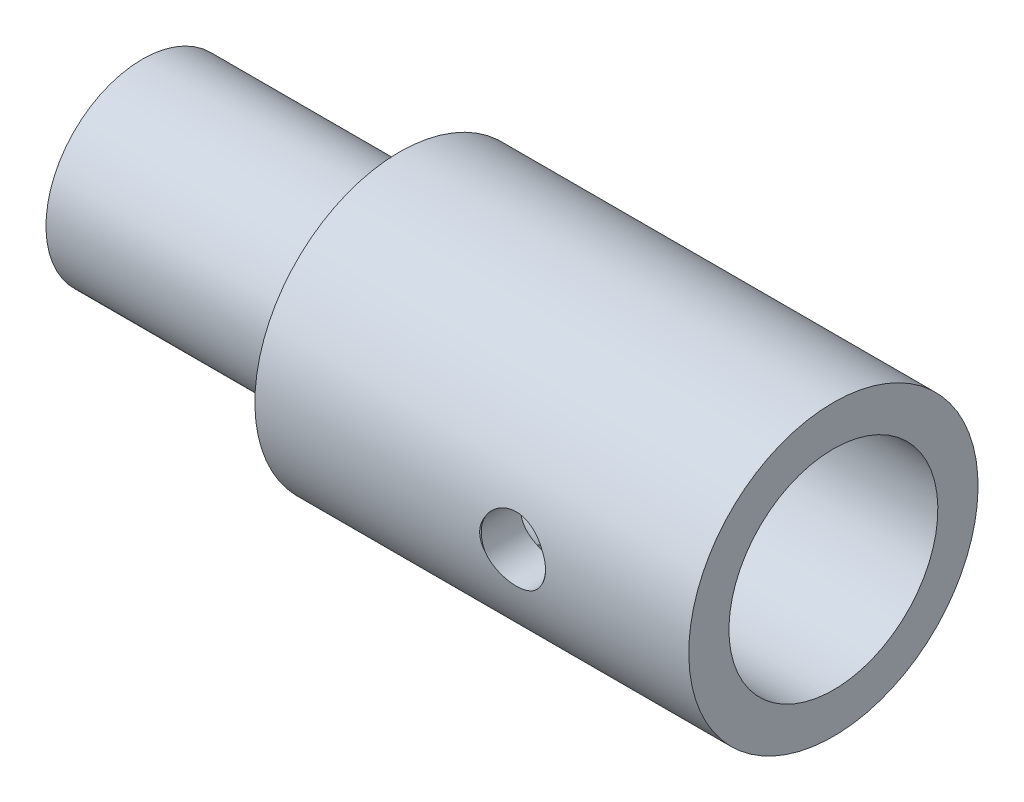
ISO-10303-21;
HEADER;
FILE_DESCRIPTION(('STEP AP214'),'2;1');
FILE_NAME('part.step','',(''),(''),'','','');
FILE_SCHEMA(('AUTOMOTIVE_DESIGN { 1 0 10303 214 1 1 1 1 }'));
ENDSEC;
DATA;
#1=APPLICATION_CONTEXT('core data for automotive mechanical design processes');
#2=APPLICATION_PROTOCOL_DEFINITION('international standard','automotive_design',2000,#1);
#3=PRODUCT_CONTEXT('',#1,'mechanical');
#4=PRODUCT('Part','Part','',(#3));
#5=PRODUCT_RELATED_PRODUCT_CATEGORY('part','',(#4));
#6=PRODUCT_DEFINITION_FORMATION('','',#4);
#7=PRODUCT_DEFINITION_CONTEXT('part definition',#1,'design');
#8=PRODUCT_DEFINITION('design','',#6,#7);
#9=PRODUCT_DEFINITION_SHAPE('','',#8);
#10=(LENGTH_UNIT() NAMED_UNIT(*) SI_UNIT(.MILLI.,.METRE.));
#11=(NAMED_UNIT(*) PLANE_ANGLE_UNIT() SI_UNIT($,.RADIAN.));
#12=(NAMED_UNIT(*) SI_UNIT($,.STERADIAN.) SOLID_ANGLE_UNIT());
#13=UNCERTAINTY_MEASURE_WITH_UNIT(LENGTH_MEASURE(1.E-05),#10,'distance_accuracy_value','');
#14=(GEOMETRIC_REPRESENTATION_CONTEXT(3) GLOBAL_UNCERTAINTY_ASSIGNED_CONTEXT((#13)) GLOBAL_UNIT_ASSIGNED_CONTEXT((#10,
#11,#12)) REPRESENTATION_CONTEXT('',''));
#15=CARTESIAN_POINT('',(0.,0.,0.));
#16=DIRECTION('',(0.,0.,1.));
#17=DIRECTION('',(1.,0.,0.));
#18=AXIS2_PLACEMENT_3D('',#15,#16,#17);
#19=CARTESIAN_POINT('',(5.50148488713848E-12,-1.97187415547967,0.));
#20=DIRECTION('',(1.,0.,0.));
#21=DIRECTION('',(0.,1.,0.));
#22=AXIS2_PLACEMENT_3D('',#19,#20,#21);
#23=CYLINDRICAL_SURFACE('',#22,4.5);
#24=CARTESIAN_POINT('',(4.06816565897068,-2.97786365577194,-4.38611275793289));
#25=CARTESIAN_POINT('',(4.12358684281742,-2.97786178204329,-4.38611388022008));
#26=CARTESIAN_POINT('',(4.17903036526716,-2.97324217517765,-4.38718060281187));
#27=CARTESIAN_POINT('',(4.28833907198498,-2.95490686869423,-4.3913246091951));
#28=CARTESIAN_POINT('',(4.34220311067269,-2.94118472957492,-4.39440331632338));
#29=CARTESIAN_POINT('',(4.44675587011614,-2.90509875425354,-4.40220739017265));
#30=CARTESIAN_POINT('',(4.49744806597373,-2.88274457510956,-4.40693091618149));
#31=CARTESIAN_POINT('',(4.5943631624964,-2.83005637971181,-4.41749273320052));
#32=CARTESIAN_POINT('',(4.64058612484138,-2.79972247360778,-4.42333100882273));
#33=CARTESIAN_POINT('',(4.72805694465566,-2.73137150551466,-4.4355816738797));
#34=CARTESIAN_POINT('',(4.76921554003076,-2.69324154702862,-4.44200162318491));
#35=CARTESIAN_POINT('',(4.84460703518999,-2.61062370478768,-4.45463155503406));
#36=CARTESIAN_POINT('',(4.87883938579245,-2.56613531735005,-4.46084152089593));
#37=CARTESIAN_POINT('',(4.9397610346684,-2.47146302093907,-4.47243852091702));
#38=CARTESIAN_POINT('',(4.96636428369726,-2.42122245170821,-4.47781587473164));
#39=CARTESIAN_POINT('',(5.01071555983091,-2.31684403991639,-4.48706330066551));
#40=CARTESIAN_POINT('',(5.02846461320618,-2.26270664986017,-4.49093354745883));
#41=CARTESIAN_POINT('',(5.05432237544011,-2.15299925218796,-4.49668331515777));
#42=CARTESIAN_POINT('',(5.06258221357088,-2.09746652512711,-4.49859399063802));
#43=CARTESIAN_POINT('',(5.06969979440689,-1.98577249915794,-4.50032496339697));
#44=CARTESIAN_POINT('',(5.06855864593759,-1.92961127515974,-4.50014550720102));
#45=CARTESIAN_POINT('',(5.05701879772266,-1.8192970324395,-4.49774525964353));
#46=CARTESIAN_POINT('',(5.04678301942513,-1.7651260671216,-4.49556037099857));
#47=CARTESIAN_POINT('',(5.0176043251931,-1.65928808602436,-4.48944335927617));
#48=CARTESIAN_POINT('',(4.99866100734405,-1.60762118594706,-4.48551115554806));
#49=CARTESIAN_POINT('',(4.95246217192021,-1.5078085246682,-4.47629047558497));
#50=CARTESIAN_POINT('',(4.92514530069846,-1.45969211986332,-4.47099203593512));
#51=CARTESIAN_POINT('',(4.86302061199618,-1.36866595602941,-4.45962410322717));
#52=CARTESIAN_POINT('',(4.8282117434357,-1.3257569288849,-4.45355450202897));
#53=CARTESIAN_POINT('',(4.7512055620442,-1.2453947072631,-4.44116186417056));
#54=CARTESIAN_POINT('',(4.70886567098526,-1.20807842128984,-4.43483618409231));
#55=CARTESIAN_POINT('',(4.61846428516214,-1.14105047855525,-4.42277009160468));
#56=CARTESIAN_POINT('',(4.57040262508354,-1.11133904159283,-4.41702969611435));
#57=CARTESIAN_POINT('',(4.46969571479634,-1.06030125801364,-4.40678088796344));
#58=CARTESIAN_POINT('',(4.41703654756835,-1.03900153035072,-4.40227639985761));
#59=CARTESIAN_POINT('',(4.30876257332954,-1.0055976940685,-4.39506596897663));
#60=CARTESIAN_POINT('',(4.25314825354202,-0.993492074596205,-4.39235973070713));
#61=CARTESIAN_POINT('',(4.14179566544082,-0.979034396203422,-4.38911420354963));
#62=CARTESIAN_POINT('',(4.08608459345075,-0.976482597592141,-4.38853054587544));
#63=CARTESIAN_POINT('',(3.9750331974894,-0.980663650115781,-4.38947675954616));
#64=CARTESIAN_POINT('',(3.91969284744146,-0.987395841173553,-4.39100648063315));
#65=CARTESIAN_POINT('',(3.81165389022239,-1.0097800855435,-4.39596433032525));
#66=CARTESIAN_POINT('',(3.75893117132254,-1.02532147177501,-4.39936889109465));
#67=CARTESIAN_POINT('',(3.65683734340634,-1.06476242955664,-4.4076696724518));
#68=CARTESIAN_POINT('',(3.60746656422095,-1.08866282221392,-4.41256603957395));
#69=CARTESIAN_POINT('',(3.51261585808247,-1.14458049664969,-4.42339303553741));
#70=CARTESIAN_POINT('',(3.46721000147815,-1.17672042314935,-4.4293388269128));
#71=CARTESIAN_POINT('',(3.38236148026634,-1.24804421453478,-4.44155112847036));
#72=CARTESIAN_POINT('',(3.34291958245639,-1.28722898377405,-4.44781767975484));
#73=CARTESIAN_POINT('',(3.27033998721639,-1.37243458019633,-4.46010726941679));
#74=CARTESIAN_POINT('',(3.23733864103595,-1.4185727395202,-4.46612327448254));
#75=CARTESIAN_POINT('',(3.17955359185368,-1.51585244292499,-4.47710135779606));
#76=CARTESIAN_POINT('',(3.15476949865396,-1.5669937492811,-4.48206348608336));
#77=CARTESIAN_POINT('',(3.11431060165398,-1.67250379584717,-4.49034037317875));
#78=CARTESIAN_POINT('',(3.0985770610236,-1.72684914268447,-4.49366573355759));
#79=CARTESIAN_POINT('',(3.07648307896242,-1.83749326969315,-4.49833355276864));
#80=CARTESIAN_POINT('',(3.07012122861376,-1.89379175493145,-4.49967630966085));
#81=CARTESIAN_POINT('',(3.06701626778621,-2.00545095950041,-4.50021372662241));
#82=CARTESIAN_POINT('',(3.07006984364107,-2.06080590366832,-4.49945382739966));
#83=CARTESIAN_POINT('',(3.08525313424904,-2.17018990459246,-4.49596105327091));
#84=CARTESIAN_POINT('',(3.09738267551814,-2.22421898667171,-4.49322821607698));
#85=CARTESIAN_POINT('',(3.1302748375681,-2.32925470319202,-4.48609441855509));
#86=CARTESIAN_POINT('',(3.15100777092128,-2.38027104867429,-4.48169919912522));
#87=CARTESIAN_POINT('',(3.20048956074017,-2.47812581487664,-4.47170339578977));
#88=CARTESIAN_POINT('',(3.22923922205992,-2.52496381548064,-4.46610269087016));
#89=CARTESIAN_POINT('',(3.29459679770311,-2.61412168091815,-4.45416467449891));
#90=CARTESIAN_POINT('',(3.33134717681878,-2.65633548036275,-4.44781511651287));
#91=CARTESIAN_POINT('',(3.41137672719349,-2.73406625709728,-4.43515701366091));
#92=CARTESIAN_POINT('',(3.45465747685313,-2.76958161068036,-4.42884847909599));
#93=CARTESIAN_POINT('',(3.54724290887576,-2.83338479118774,-4.41688470759027));
#94=CARTESIAN_POINT('',(3.59662296738546,-2.86156528376162,-4.41123977134785));
#95=CARTESIAN_POINT('',(3.69953410670133,-2.90918455284614,-4.40136855073445));
#96=CARTESIAN_POINT('',(3.75306168103588,-2.92863062123867,-4.39714108374806));
#97=CARTESIAN_POINT('',(3.85021889599066,-2.95481753246029,-4.39135014366362));
#98=CARTESIAN_POINT('',(3.89332737260432,-2.96344303980899,-4.38939927902104));
#99=CARTESIAN_POINT('',(3.98034113726387,-2.97496669518073,-4.38678017477402));
#100=CARTESIAN_POINT('',(4.02424638381067,-2.97786514063383,-4.38611186856106));
#101=CARTESIAN_POINT('',(4.06816565897068,-2.97786365577194,-4.38611275793289));
#102=B_SPLINE_CURVE_WITH_KNOTS('',3,(#24,#25,#26,#27,#28,#29,#30,#31,#32,#33,#34,#35,#36,#37,
#38,#39,#40,#41,#42,#43,#44,#45,#46,#47,#48,#49,#50,#51,#52,#53,#54,#55,#56,#57,#58,#59,#60,#61,
#62,#63,#64,#65,#66,#67,#68,#69,#70,#71,#72,#73,#74,#75,#76,#77,#78,#79,#80,#81,#82,#83,#84,#85,
#86,#87,#88,#89,#90,#91,#92,#93,#94,#95,#96,#97,#98,#99,#100,#101),.UNSPECIFIED.,.T.,.F.,(4,2,2,
2,2,2,2,2,2,2,2,2,2,2,2,2,2,2,2,2,2,2,2,2,2,2,2,2,2,2,2,2,2,2,2,2,2,2,4),(0.,0.166102558494591,
0.332322750192434,0.498357520008391,0.664389998050726,0.8330229695677,1.00166930675099,
1.17214906318353,1.34260905508582,1.51031485736443,1.67800087939989,1.84274220917405,
2.00749114368963,2.17347729000196,2.33948673831992,2.50906023645939,2.67863863513816,
2.84874944722111,3.01883229921633,3.18533874755265,3.35183335815117,3.51628128972295,
3.68074537959258,3.84781614360498,4.01490836999235,4.18522523018715,4.35553400169375,
4.52472464724765,4.6938898544815,4.85942793779578,5.02496285698629,5.18993125886615,
5.35491622901635,5.52312234724342,5.69136918646787,5.86195485764064,6.03239785047426,
6.16403493145228,6.29566517579134),.UNSPECIFIED.);
#103=CARTESIAN_POINT('',(4.06816565897068,-2.97786365577194,-4.38611275793289));
#104=VERTEX_POINT('',#103);
#105=EDGE_CURVE('E44',#104,#104,#102,.T.);
#106=ORIENTED_EDGE('',*,*,#105,.T.);
#107=EDGE_LOOP('',(#106));
#108=FACE_BOUND('',#107,.T.);
#109=CARTESIAN_POINT('',(-3.95031497845633,-1.97187415547967,0.));
#110=DIRECTION('',(1.,0.,0.));
#111=DIRECTION('',(0.,1.,0.));
#112=AXIS2_PLACEMENT_3D('',#109,#110,#111);
#113=CIRCLE('',#112,4.5);
#114=CARTESIAN_POINT('',(-3.95031497845633,2.52812584452033,0.));
#115=VERTEX_POINT('',#114);
#116=EDGE_CURVE('E158',#115,#115,#113,.T.);
#117=ORIENTED_EDGE('',*,*,#116,.T.);
#118=EDGE_LOOP('',(#117));
#119=FACE_BOUND('',#118,.T.);
#120=CARTESIAN_POINT('',(9.54968502154367,-1.97187415547967,0.));
#121=DIRECTION('',(1.,0.,0.));
#122=DIRECTION('',(0.,1.,0.));
#123=AXIS2_PLACEMENT_3D('',#120,#121,#122);
#124=CIRCLE('',#123,4.5);
#125=CARTESIAN_POINT('',(9.54968502154367,2.52812584452033,0.));
#126=VERTEX_POINT('',#125);
#127=EDGE_CURVE('E156',#126,#126,#124,.T.);
#128=ORIENTED_EDGE('',*,*,#127,.F.);
#129=EDGE_LOOP('',(#128));
#130=FACE_BOUND('',#129,.T.);
#131=CARTESIAN_POINT('',(4.92676675885765,-1.46000971657263,4.47079353092741));
#132=CARTESIAN_POINT('',(4.95559432001063,-1.49993080876618,4.47538312217792));
#133=CARTESIAN_POINT('',(4.98120629274377,-1.54227817298513,4.47967206091811));
#134=CARTESIAN_POINT('',(5.02515853043864,-1.63078110885479,4.4872693477127));
#135=CARTESIAN_POINT('',(5.04348260506502,-1.67694488725059,4.49057550842199));
#136=CARTESIAN_POINT('',(5.0720216654432,-1.77231242101153,4.49582972378611));
#137=CARTESIAN_POINT('',(5.08215585816204,-1.82154142454459,4.497764224718));
#138=CARTESIAN_POINT('',(5.09345686207469,-1.92097127359426,4.49998573066868));
#139=CARTESIAN_POINT('',(5.09464031352716,-1.97117014169085,4.50027579260054));
#140=CARTESIAN_POINT('',(5.08825001195601,-2.06749512284068,4.49922429353996));
#141=CARTESIAN_POINT('',(5.0812738326517,-2.11366360356539,4.49799374112407));
#142=CARTESIAN_POINT('',(5.0598557227474,-2.20423276144231,4.49422585348629));
#143=CARTESIAN_POINT('',(5.04540561484072,-2.24863144481492,4.49168708694445));
#144=CARTESIAN_POINT('',(5.01329597768868,-2.3257842786252,4.48619311128987));
#145=CARTESIAN_POINT('',(4.99687575856789,-2.35907801687406,4.48342583614628));
#146=CARTESIAN_POINT('',(4.96015486817057,-2.42326927745344,4.47741964307336));
#147=CARTESIAN_POINT('',(4.9398666430109,-2.45417405029689,4.47418224561396));
#148=CARTESIAN_POINT('',(4.91782093569388,-2.48373859437266,4.47079353092902));
#149=B_SPLINE_CURVE_WITH_KNOTS('',3,(#131,#132,#133,#134,#135,#136,#137,#138,#139,#140,#141,
#142,#143,#144,#145,#146,#147,#148),.UNSPECIFIED.,.F.,.F.,(4,2,2,2,2,2,2,2,4),(0.,
0.148294265471442,0.296916156242151,0.446986890739191,0.596778561073358,0.736252715249162,
0.875879793436186,0.987280835163732,1.09832929257274),.UNSPECIFIED.);
#150=CARTESIAN_POINT('',(4.94886140666111,-1.4920822894679,4.47434908844951));
#151=VERTEX_POINT('',#150);
#152=CARTESIAN_POINT('',(4.94886140666111,-2.43944617251763,4.47564256938409));
#153=VERTEX_POINT('',#152);
#154=EDGE_CURVE('E54',#151,#153,#149,.T.);
#155=ORIENTED_EDGE('',*,*,#154,.T.);
#156=CARTESIAN_POINT('',(4.94886140666111,-2.43944617251763,4.47564256938409));
#157=CARTESIAN_POINT('',(4.92209675147945,-2.4892983850331,4.47044894177626));
#158=CARTESIAN_POINT('',(4.89107600369924,-2.53676847740674,4.46463269027358));
#159=CARTESIAN_POINT('',(4.82155629345844,-2.62577121576013,4.45246031086336));
#160=CARTESIAN_POINT('',(4.78306009607188,-2.66730604728698,4.44610438306292));
#161=CARTESIAN_POINT('',(4.69958943526725,-2.74331518545971,4.43355123186775));
#162=CARTESIAN_POINT('',(4.6546129958849,-2.77778733074821,4.42735405756167));
#163=CARTESIAN_POINT('',(4.55942128941779,-2.83869009108576,4.41583413173197));
#164=CARTESIAN_POINT('',(4.50920742723644,-2.86512285523272,4.41051114669428));
#165=CARTESIAN_POINT('',(4.40509289376591,-2.90908448720926,4.40137966703202));
#166=CARTESIAN_POINT('',(4.35120550190225,-2.92664367725272,4.39756602460073));
#167=CARTESIAN_POINT('',(4.24113693328232,-2.95242544775268,4.39188978055227));
#168=CARTESIAN_POINT('',(4.1849558244366,-2.96064830442448,4.39002712121541));
#169=CARTESIAN_POINT('',(4.07325672591441,-2.96739931161196,4.38850101752864));
#170=CARTESIAN_POINT('',(4.01775224143536,-2.96614134863887,4.38878905231462));
#171=CARTESIAN_POINT('',(3.90776986392691,-2.9544796245195,4.3914145041478));
#172=CARTESIAN_POINT('',(3.85329184804213,-2.94407696507241,4.39375167432715));
#173=CARTESIAN_POINT('',(3.74725990170567,-2.9145655347416,4.40017692950285));
#174=CARTESIAN_POINT('',(3.69568878789264,-2.89551571305816,4.40425314797406));
#175=CARTESIAN_POINT('',(3.59643574678265,-2.84929011946731,4.41369399416915));
#176=CARTESIAN_POINT('',(3.54875532462719,-2.82211122156121,4.41905911737893));
#177=CARTESIAN_POINT('',(3.45762191715791,-2.75976940786963,4.43060318377352));
#178=CARTESIAN_POINT('',(3.41427330115953,-2.72445684308885,4.43679633026216));
#179=CARTESIAN_POINT('',(3.33408534878605,-2.64713666137026,4.44921841978984));
#180=CARTESIAN_POINT('',(3.29723850368676,-2.60513687543586,4.45544731284384));
#181=CARTESIAN_POINT('',(3.24993845472284,-2.54117337247036,4.46388576539817));
#182=CARTESIAN_POINT('',(3.23642090903388,-2.52144996819754,4.46636090140706));
#183=CARTESIAN_POINT('',(3.21084628000912,-2.48110652440683,4.47114016084466));
#184=CARTESIAN_POINT('',(3.19878671414678,-2.46048809262983,4.47344457230168));
#185=CARTESIAN_POINT('',(3.18746991128011,-2.43944617251774,4.47564256938413));
#186=B_SPLINE_CURVE_WITH_KNOTS('',3,(#156,#157,#158,#159,#160,#161,#162,#163,#164,#165,#166,
#167,#168,#169,#170,#171,#172,#173,#174,#175,#176,#177,#178,#179,#180,#181,#182,#183,#184,#185),
.UNSPECIFIED.,.F.,.F.,(4,2,2,2,2,2,2,2,2,2,2,2,2,2,4),(0.,0.170218717364059,0.340374592501864,
0.5105824620396,0.680744791313458,0.850321652817862,1.01989349726251,1.18565145831604,
1.35138945256247,1.51601416780789,1.68070227029701,1.84870420728641,2.01651083499246,
2.08857650527273,2.16051768630562),.UNSPECIFIED.);
#187=CARTESIAN_POINT('',(3.18746991128026,-2.43944617251763,4.47564256938409));
#188=VERTEX_POINT('',#187);
#189=EDGE_CURVE('E11',#153,#188,#186,.T.);
#190=ORIENTED_EDGE('',*,*,#189,.T.);
#191=CARTESIAN_POINT('',(3.21851038224749,-2.48373859437266,4.47079353092902));
#192=CARTESIAN_POINT('',(3.18909448438585,-2.44435194119494,4.47532061322093));
#193=CARTESIAN_POINT('',(3.16282491771422,-2.40251257223437,4.47956705159547));
#194=CARTESIAN_POINT('',(3.11742678434781,-2.31492387158165,4.48711608507328));
#195=CARTESIAN_POINT('',(3.09831593657558,-2.2691651780971,4.49041633354134));
#196=CARTESIAN_POINT('',(3.06798872564243,-2.17415945334899,4.49570765285266));
#197=CARTESIAN_POINT('',(3.05690800944216,-2.12486727940146,4.49767619299319));
#198=CARTESIAN_POINT('',(3.04377502632314,-2.02514229520986,4.4999599590837));
#199=CARTESIAN_POINT('',(3.04170549163747,-1.97471185284942,4.50027834737683));
#200=CARTESIAN_POINT('',(3.04648234877667,-1.87794870803104,4.49926137605582));
#201=CARTESIAN_POINT('',(3.0526983639326,-1.83158209120103,4.49804327874919));
#202=CARTESIAN_POINT('',(3.07267166076871,-1.74050588712859,4.4942794801731));
#203=CARTESIAN_POINT('',(3.0864369603524,-1.69579811569803,4.49173236753018));
#204=CARTESIAN_POINT('',(3.11727945089497,-1.61832394069776,4.48622127780173));
#205=CARTESIAN_POINT('',(3.13306070264191,-1.58501651345403,4.48345608979335));
#206=CARTESIAN_POINT('',(3.16850336288705,-1.52071383356693,4.47744374692934));
#207=CARTESIAN_POINT('',(3.18815250310837,-1.48971168663575,4.47419812380264));
#208=CARTESIAN_POINT('',(3.20956455908323,-1.46000971657329,4.47079353092749));
#209=B_SPLINE_CURVE_WITH_KNOTS('',3,(#191,#192,#193,#194,#195,#196,#197,#198,#199,#200,#201,
#202,#203,#204,#205,#206,#207,#208),.UNSPECIFIED.,.F.,.F.,(4,2,2,2,2,2,2,2,4),(0.,
0.148032941434335,0.296429903199984,0.447278635599808,0.597838175030961,0.737572129989509,
0.877454781051428,0.988063833630184,1.09832754780317),.UNSPECIFIED.);
#210=CARTESIAN_POINT('',(3.18746991128025,-1.49208228946788,4.47434908844951));
#211=VERTEX_POINT('',#210);
#212=EDGE_CURVE('E64',#188,#211,#209,.T.);
#213=ORIENTED_EDGE('',*,*,#212,.T.);
#214=CARTESIAN_POINT('',(3.18746991128026,-1.4920822894679,4.47434908844951));
#215=CARTESIAN_POINT('',(3.21423456646192,-1.44224444500525,4.46901934926895));
#216=CARTESIAN_POINT('',(3.24525531424213,-1.39479041199589,4.46307349334645));
#217=CARTESIAN_POINT('',(3.31477502448292,-1.30582124446931,4.45065812043472));
#218=CARTESIAN_POINT('',(3.35327122186949,-1.26430392386672,4.44418879758378));
#219=CARTESIAN_POINT('',(3.43674188267411,-1.18832934784593,4.43142813580034));
#220=CARTESIAN_POINT('',(3.48171832205646,-1.15387425364301,4.4251368518583));
#221=CARTESIAN_POINT('',(3.57691002852357,-1.09300317771755,4.41345066242245));
#222=CARTESIAN_POINT('',(3.62712389070493,-1.06658504754275,4.40805551754692));
#223=CARTESIAN_POINT('',(3.73123842417545,-1.02264851471002,4.39880402634273));
#224=CARTESIAN_POINT('',(3.78512581603912,-1.00509980400831,4.394942449426));
#225=CARTESIAN_POINT('',(3.89519438465904,-0.979333629694225,4.38919582451858));
#226=CARTESIAN_POINT('',(3.95137549350477,-0.971115890025198,4.38731071805417));
#227=CARTESIAN_POINT('',(4.06307459202695,-0.964369075323786,4.38576618514966));
#228=CARTESIAN_POINT('',(4.118579076506,-0.965626247073062,4.38605765396862));
#229=CARTESIAN_POINT('',(4.22856145401445,-0.977280758418587,4.38871494056622));
#230=CARTESIAN_POINT('',(4.28303946989923,-0.987676996993859,4.39108050846954));
#231=CARTESIAN_POINT('',(4.3890714162357,-1.01717077191619,4.3975863262563));
#232=CARTESIAN_POINT('',(4.44064253004872,-1.03620939168653,4.40171454868684));
#233=CARTESIAN_POINT('',(4.53989557115872,-1.08240903290867,4.41128158744769));
#234=CARTESIAN_POINT('',(4.58757599331417,-1.10957317899448,4.41672090779817));
#235=CARTESIAN_POINT('',(4.67870940078345,-1.1718832369883,4.42843516731746));
#236=CARTESIAN_POINT('',(4.72205801678184,-1.20717875854885,4.43472471838215));
#237=CARTESIAN_POINT('',(4.80224596915531,-1.28446473111626,4.44735789904019));
#238=CARTESIAN_POINT('',(4.8390928142546,-1.3264473512854,4.45370145726465));
#239=CARTESIAN_POINT('',(4.88639286321852,-1.39038757297547,4.46231454285309));
#240=CARTESIAN_POINT('',(4.89991040890748,-1.41010414488367,4.46484352813592));
#241=CARTESIAN_POINT('',(4.92548503793224,-1.45043438758449,4.46973293519183));
#242=CARTESIAN_POINT('',(4.93754460379458,-1.47104644985571,4.47209364060192));
#243=CARTESIAN_POINT('',(4.94886140666125,-1.49208228946778,4.47434908844954));
#244=B_SPLINE_CURVE_WITH_KNOTS('',3,(#214,#215,#216,#217,#218,#219,#220,#221,#222,#223,#224,
#225,#226,#227,#228,#229,#230,#231,#232,#233,#234,#235,#236,#237,#238,#239,#240,#241,#242,#243),
.UNSPECIFIED.,.F.,.F.,(4,2,2,2,2,2,2,2,2,2,2,2,2,2,4),(0.,0.170218717364059,0.340374592501863,
0.510582462039597,0.680744791313457,0.850321652817862,1.01989349726251,1.18565145831604,
1.35138945256247,1.51601416780789,1.68070227029701,1.84870420728641,2.01651083499246,
2.08857650527273,2.16051768630562),.UNSPECIFIED.);
#245=EDGE_CURVE('E73',#211,#151,#244,.T.);
#246=ORIENTED_EDGE('',*,*,#245,.T.);
#247=EDGE_LOOP('',(#155,#190,#213,#246));
#248=FACE_BOUND('',#247,.T.);
#249=ADVANCED_FACE('F40',(#108,#119,#130,#248),#23,.T.);
#250=CARTESIAN_POINT('',(-3.95031497845633,0.,0.));
#251=DIRECTION('',(-1.,0.,0.));
#252=DIRECTION('',(0.,-1.,0.));
#253=AXIS2_PLACEMENT_3D('',#250,#251,#252);
#254=PLANE('',#253);
#255=CARTESIAN_POINT('',(-3.95031497845633,-1.97187415547967,0.));
#256=DIRECTION('',(1.,0.,0.));
#257=DIRECTION('',(0.,1.,0.));
#258=AXIS2_PLACEMENT_3D('',#255,#256,#257);
#259=CIRCLE('',#258,3.);
#260=CARTESIAN_POINT('',(-3.95031497845633,1.02812584452033,0.));
#261=VERTEX_POINT('',#260);
#262=EDGE_CURVE('E132',#261,#261,#259,.T.);
#263=ORIENTED_EDGE('',*,*,#262,.T.);
#264=EDGE_LOOP('',(#263));
#265=FACE_BOUND('',#264,.T.);
#266=ORIENTED_EDGE('',*,*,#116,.F.);
#267=EDGE_LOOP('',(#266));
#268=FACE_BOUND('',#267,.T.);
#269=ADVANCED_FACE('F42',(#265,#268),#254,.T.);
#270=CARTESIAN_POINT('',(5.50148488713848E-12,-1.97187415547967,0.));
#271=DIRECTION('',(1.,0.,0.));
#272=DIRECTION('',(0.,1.,0.));
#273=AXIS2_PLACEMENT_3D('',#270,#271,#272);
#274=CYLINDRICAL_SURFACE('',#273,3.);
#275=CARTESIAN_POINT('',(-11.9503149784563,-1.97187415547967,0.));
#276=DIRECTION('',(1.,0.,0.));
#277=DIRECTION('',(0.,1.,0.));
#278=AXIS2_PLACEMENT_3D('',#275,#276,#277);
#279=CIRCLE('',#278,3.);
#280=CARTESIAN_POINT('',(-11.9503149784563,1.02812584452033,0.));
#281=VERTEX_POINT('',#280);
#282=EDGE_CURVE('E135',#281,#281,#279,.T.);
#283=ORIENTED_EDGE('',*,*,#282,.T.);
#284=EDGE_LOOP('',(#283));
#285=FACE_BOUND('',#284,.T.);
#286=ORIENTED_EDGE('',*,*,#262,.F.);
#287=EDGE_LOOP('',(#286));
#288=FACE_BOUND('',#287,.T.);
#289=ADVANCED_FACE('F187',(#285,#288),#274,.T.);
#290=CARTESIAN_POINT('',(-11.9503149784563,0.,0.));
#291=DIRECTION('',(1.,0.,0.));
#292=DIRECTION('',(0.,1.,0.));
#293=AXIS2_PLACEMENT_3D('',#290,#291,#292);
#294=PLANE('',#293);
#295=ORIENTED_EDGE('',*,*,#282,.F.);
#296=EDGE_LOOP('',(#295));
#297=FACE_BOUND('',#296,.T.);
#298=CARTESIAN_POINT('',(-11.9503149784563,-1.97187415547967,0.));
#299=DIRECTION('',(1.,0.,0.));
#300=DIRECTION('',(0.,1.,0.));
#301=AXIS2_PLACEMENT_3D('',#298,#299,#300);
#302=CIRCLE('',#301,1.5);
#303=CARTESIAN_POINT('',(-11.9503149784563,-0.471874155479668,0.));
#304=VERTEX_POINT('',#303);
#305=EDGE_CURVE('E138',#304,#304,#302,.T.);
#306=ORIENTED_EDGE('',*,*,#305,.T.);
#307=EDGE_LOOP('',(#306));
#308=FACE_BOUND('',#307,.T.);
#309=ADVANCED_FACE('F195',(#297,#308),#294,.F.);
#310=CARTESIAN_POINT('',(5.50148488713848E-12,-1.97187415547967,0.));
#311=DIRECTION('',(1.,0.,0.));
#312=DIRECTION('',(0.,1.,0.));
#313=AXIS2_PLACEMENT_3D('',#310,#311,#312);
#314=CYLINDRICAL_SURFACE('',#313,1.5);
#315=ORIENTED_EDGE('',*,*,#305,.F.);
#316=EDGE_LOOP('',(#315));
#317=FACE_BOUND('',#316,.T.);
#318=CARTESIAN_POINT('',(-2.45031497845633,-1.97187415547967,0.));
#319=DIRECTION('',(1.,0.,0.));
#320=DIRECTION('',(0.,1.,0.));
#321=AXIS2_PLACEMENT_3D('',#318,#319,#320);
#322=CIRCLE('',#321,1.5);
#323=CARTESIAN_POINT('',(-2.45031497845633,-0.471874155479667,0.));
#324=VERTEX_POINT('',#323);
#325=EDGE_CURVE('E141',#324,#324,#322,.T.);
#326=ORIENTED_EDGE('',*,*,#325,.T.);
#327=EDGE_LOOP('',(#326));
#328=FACE_BOUND('',#327,.T.);
#329=ADVANCED_FACE('F203',(#317,#328),#314,.F.);
#330=CARTESIAN_POINT('',(-2.45031497845633,0.,0.));
#331=DIRECTION('',(-1.,0.,0.));
#332=DIRECTION('',(0.,-1.,0.));
#333=AXIS2_PLACEMENT_3D('',#330,#331,#332);
#334=PLANE('',#333);
#335=ORIENTED_EDGE('',*,*,#325,.F.);
#336=EDGE_LOOP('',(#335));
#337=FACE_BOUND('',#336,.T.);
#338=CARTESIAN_POINT('',(-2.45031497845633,-1.97187415547967,0.));
#339=DIRECTION('',(1.,0.,0.));
#340=DIRECTION('',(0.,1.,0.));
#341=AXIS2_PLACEMENT_3D('',#338,#339,#340);
#342=CIRCLE('',#341,3.);
#343=CARTESIAN_POINT('',(-2.45031497845633,1.02812584452033,0.));
#344=VERTEX_POINT('',#343);
#345=EDGE_CURVE('E144',#344,#344,#342,.T.);
#346=ORIENTED_EDGE('',*,*,#345,.T.);
#347=EDGE_LOOP('',(#346));
#348=FACE_BOUND('',#347,.T.);
#349=ADVANCED_FACE('F209',(#337,#348),#334,.F.);
#350=CARTESIAN_POINT('',(5.50148488713848E-12,-1.97187415547967,0.));
#351=DIRECTION('',(1.,0.,0.));
#352=DIRECTION('',(0.,1.,0.));
#353=AXIS2_PLACEMENT_3D('',#350,#351,#352);
#354=CYLINDRICAL_SURFACE('',#353,3.);
#355=ORIENTED_EDGE('',*,*,#345,.F.);
#356=EDGE_LOOP('',(#355));
#357=FACE_BOUND('',#356,.T.);
#358=CARTESIAN_POINT('',(1.54968502154367,-1.97187415547967,0.));
#359=DIRECTION('',(1.,0.,0.));
#360=DIRECTION('',(0.,1.,0.));
#361=AXIS2_PLACEMENT_3D('',#358,#359,#360);
#362=CIRCLE('',#361,3.);
#363=CARTESIAN_POINT('',(1.54968502154367,1.02812584452033,0.));
#364=VERTEX_POINT('',#363);
#365=EDGE_CURVE('E147',#364,#364,#362,.T.);
#366=ORIENTED_EDGE('',*,*,#365,.T.);
#367=EDGE_LOOP('',(#366));
#368=FACE_BOUND('',#367,.T.);
#369=ADVANCED_FACE('F213',(#357,#368),#354,.F.);
#370=CARTESIAN_POINT('',(1.54968502154367,0.,0.));
#371=DIRECTION('',(-1.,0.,0.));
#372=DIRECTION('',(0.,-1.,0.));
#373=AXIS2_PLACEMENT_3D('',#370,#371,#372);
#374=PLANE('',#373);
#375=ORIENTED_EDGE('',*,*,#365,.F.);
#376=EDGE_LOOP('',(#375));
#377=FACE_BOUND('',#376,.T.);
#378=CARTESIAN_POINT('',(1.54968502154367,-1.97187415547967,0.));
#379=DIRECTION('',(1.,0.,0.));
#380=DIRECTION('',(0.,1.,0.));
#381=AXIS2_PLACEMENT_3D('',#378,#379,#380);
#382=CIRCLE('',#381,3.25);
#383=CARTESIAN_POINT('',(1.54968502154367,1.27812584452033,0.));
#384=VERTEX_POINT('',#383);
#385=EDGE_CURVE('E150',#384,#384,#382,.T.);
#386=ORIENTED_EDGE('',*,*,#385,.T.);
#387=EDGE_LOOP('',(#386));
#388=FACE_BOUND('',#387,.T.);
#389=ADVANCED_FACE('F169',(#377,#388),#374,.F.);
#390=CARTESIAN_POINT('',(5.50148488713848E-12,-1.97187415547967,0.));
#391=DIRECTION('',(1.,0.,0.));
#392=DIRECTION('',(0.,1.,0.));
#393=AXIS2_PLACEMENT_3D('',#390,#391,#392);
#394=CYLINDRICAL_SURFACE('',#393,3.25);
#395=CARTESIAN_POINT('',(4.06816565897068,-2.9760953235098,-3.09096099064356));
#396=CARTESIAN_POINT('',(4.01344175065501,-2.97609482888152,-3.09096142333725));
#397=CARTESIAN_POINT('',(3.95871291660165,-2.97159001195936,-3.09243568488385));
#398=CARTESIAN_POINT('',(3.85086006817429,-2.95373914216064,-3.09814889045211));
#399=CARTESIAN_POINT('',(3.79773653174845,-2.94039048278803,-3.10238864952763));
#400=CARTESIAN_POINT('',(3.69467175496741,-2.90535142355947,-3.11310975159062));
#401=CARTESIAN_POINT('',(3.64472518858723,-2.88367543793587,-3.11958721926219));
#402=CARTESIAN_POINT('',(3.54916573352565,-2.83264411419068,-3.1340510173688));
#403=CARTESIAN_POINT('',(3.50355356735484,-2.80328749881859,-3.14203759870052));
#404=CARTESIAN_POINT('',(3.41643887423346,-2.73668060378964,-3.15892131617999));
#405=CARTESIAN_POINT('',(3.37510194722426,-2.69921880911786,-3.16783866005767));
#406=CARTESIAN_POINT('',(3.29918879992915,-2.61791663059981,-3.18541308956139));
#407=CARTESIAN_POINT('',(3.26461349397977,-2.57407538549188,-3.19407013985561));
#408=CARTESIAN_POINT('',(3.20247883997086,-2.48007275835211,-3.21038246083664));
#409=CARTESIAN_POINT('',(3.17508937504422,-2.42979417213974,-3.21801169703697));
#410=CARTESIAN_POINT('',(3.12922118796603,-2.32506941545758,-3.23118143163716));
#411=CARTESIAN_POINT('',(3.11074043881151,-2.27062419629308,-3.23672240511744));
#412=CARTESIAN_POINT('',(3.08376530166443,-2.16084421254822,-3.24495422654848));
#413=CARTESIAN_POINT('',(3.07498802060969,-2.10558510455333,-3.24772557292703));
#414=CARTESIAN_POINT('',(3.06677335575731,-1.99431333614207,-3.25039855163219));
#415=CARTESIAN_POINT('',(3.06733391169282,-1.93830084467457,-3.25030081697892));
#416=CARTESIAN_POINT('',(3.07759143633481,-1.82910093850913,-3.24730683058166));
#417=CARTESIAN_POINT('',(3.08698186132144,-1.77588172807948,-3.24450439139088));
#418=CARTESIAN_POINT('',(3.11413045417912,-1.67181161981238,-3.23653946543874));
#419=CARTESIAN_POINT('',(3.13188916195708,-1.62096087501682,-3.23137682640207));
#420=CARTESIAN_POINT('',(3.17547128067999,-1.52235600034353,-3.21915105325607));
#421=CARTESIAN_POINT('',(3.20138902851175,-1.47464641888835,-3.21206582925036));
#422=CARTESIAN_POINT('',(3.26047825517344,-1.3841554694564,-3.19674773192612));
#423=CARTESIAN_POINT('',(3.29365152493011,-1.34137532223107,-3.1885145754383));
#424=CARTESIAN_POINT('',(3.36789021430583,-1.26012944669509,-3.17138991576054));
#425=CARTESIAN_POINT('',(3.40922065151103,-1.22190832067389,-3.16248525364513));
#426=CARTESIAN_POINT('',(3.49778762863184,-1.15286888880206,-3.14531386202305));
#427=CARTESIAN_POINT('',(3.54502481983615,-1.12205140038536,-3.13704720302649));
#428=CARTESIAN_POINT('',(3.64473719309282,-1.06842188668121,-3.1220283555924));
#429=CARTESIAN_POINT('',(3.69726236636177,-1.04569772466688,-3.11529306015305));
#430=CARTESIAN_POINT('',(3.80565001763472,-1.00949553570225,-3.10430176826634));
#431=CARTESIAN_POINT('',(3.86151133255048,-0.996014306584042,-3.10004491325284));
#432=CARTESIAN_POINT('',(3.97264792304254,-0.979147626342282,-3.0946841166353));
#433=CARTESIAN_POINT('',(4.02786089908035,-0.975388489497215,-3.09346354406874));
#434=CARTESIAN_POINT('',(4.13813135194872,-0.977025937534028,-3.0939906485695));
#435=CARTESIAN_POINT('',(4.19318885069428,-0.982421160178916,-3.09573788400489));
#436=CARTESIAN_POINT('',(4.29999696134512,-1.00188044588098,-3.10188818336532));
#437=CARTESIAN_POINT('',(4.35179694387042,-1.01569971435293,-3.10621617813459));
#438=CARTESIAN_POINT('',(4.45233910001353,-1.05132830543781,-3.11695993632535));
#439=CARTESIAN_POINT('',(4.50108078362808,-1.07313890461922,-3.12337603329068));
#440=CARTESIAN_POINT('',(4.59563111478657,-1.12482712247447,-3.1377935549103));
#441=CARTESIAN_POINT('',(4.64131958504063,-1.15491332324003,-3.14583430360403));
#442=CARTESIAN_POINT('',(4.7271374317462,-1.22205259754728,-3.16250881808526));
#443=CARTESIAN_POINT('',(4.76726540367208,-1.25910742574267,-3.17114273287975));
#444=CARTESIAN_POINT('',(4.8424779482891,-1.34089461847025,-3.18844439117499));
#445=CARTESIAN_POINT('',(4.87729663282125,-1.3858747667114,-3.19709967774365));
#446=CARTESIAN_POINT('',(4.93890267704236,-1.48124756879589,-3.21311689501568));
#447=CARTESIAN_POINT('',(4.96569041803042,-1.53163996551811,-3.22047888711617));
#448=CARTESIAN_POINT('',(5.01021621047039,-1.63608587425892,-3.23303095829057));
#449=CARTESIAN_POINT('',(5.02802072977182,-1.69010904123979,-3.23823693691201));
#450=CARTESIAN_POINT('',(5.05423654184853,-1.80056974211083,-3.24595368385344));
#451=CARTESIAN_POINT('',(5.06265067552142,-1.85700654043096,-3.24846526730686));
#452=CARTESIAN_POINT('',(5.06962178427917,-1.96824085921253,-3.2504548455534));
#453=CARTESIAN_POINT('',(5.06856340456254,-2.02301244511263,-3.25005134404298));
#454=CARTESIAN_POINT('',(5.05754556021808,-2.13155890103875,-3.24652880615436));
#455=CARTESIAN_POINT('',(5.04758664603412,-2.18533383249187,-3.24340993770538));
#456=CARTESIAN_POINT('',(5.01929275284878,-2.28973920215744,-3.23483784633966));
#457=CARTESIAN_POINT('',(5.00105803563225,-2.34039926594359,-3.22941261357459));
#458=CARTESIAN_POINT('',(4.95682034197907,-2.43796362488212,-3.21678149647655));
#459=CARTESIAN_POINT('',(4.93081605357607,-2.48486728403217,-3.20957531144831));
#460=CARTESIAN_POINT('',(4.87077829081115,-2.57528111140272,-3.19383418780155));
#461=CARTESIAN_POINT('',(4.8365069920692,-2.61862700090984,-3.18526308852202));
#462=CARTESIAN_POINT('',(4.76133091421195,-2.69908011176357,-3.16786505540893));
#463=CARTESIAN_POINT('',(4.7204241794457,-2.73618548726689,-3.15903804678346));
#464=CARTESIAN_POINT('',(4.63157717089676,-2.80429476574428,-3.14179114289563));
#465=CARTESIAN_POINT('',(4.58345448139932,-2.83506689847685,-3.13339314535894));
#466=CARTESIAN_POINT('',(4.48247028223406,-2.88805365443597,-3.1183133758773));
#467=CARTESIAN_POINT('',(4.42961084395207,-2.91027199594985,-3.1116308586441));
#468=CARTESIAN_POINT('',(4.32577155987103,-2.94375076445547,-3.10132772738244));
#469=CARTESIAN_POINT('',(4.27508250336881,-2.95584525478414,-3.09747825047295));
#470=CARTESIAN_POINT('',(4.17231879246022,-2.97201685701452,-3.09229496258288));
#471=CARTESIAN_POINT('',(4.12024445625005,-2.97609579422994,-3.09096057886436));
#472=CARTESIAN_POINT('',(4.06816565897068,-2.9760953235098,-3.09096099064356));
#473=B_SPLINE_CURVE_WITH_KNOTS('',3,(#395,#396,#397,#398,#399,#400,#401,#402,#403,#404,#405,
#406,#407,#408,#409,#410,#411,#412,#413,#414,#415,#416,#417,#418,#419,#420,#421,#422,#423,#424,
#425,#426,#427,#428,#429,#430,#431,#432,#433,#434,#435,#436,#437,#438,#439,#440,#441,#442,#443,
#444,#445,#446,#447,#448,#449,#450,#451,#452,#453,#454,#455,#456,#457,#458,#459,#460,#461,#462,
#463,#464,#465,#466,#467,#468,#469,#470,#471,#472),.UNSPECIFIED.,.T.,.F.,(4,2,2,2,2,2,2,2,2,2,2,
2,2,2,2,2,2,2,2,2,2,2,2,2,2,2,2,2,2,2,2,2,2,2,2,2,2,2,4),(0.,0.163979452388176,
0.328007255032055,0.491752402866522,0.655524798030859,0.824240464308517,0.992978929318986,
1.1654058618738,1.33779354353358,1.50501085883543,1.67219128039742,1.83377398595501,
1.99536711797258,2.15890185767664,2.32247700935133,2.49267060735142,2.66288298776025,
2.83489062843882,3.00683864777734,3.17207203704887,3.33728084051563,3.49790363325029,
3.65855209573432,3.82369414076311,3.98887782326073,4.16066780100947,4.33244962109382,
4.5029410515501,4.6733808887997,4.83693218558168,5.00047336841143,5.16208405231616,
5.32372204116741,5.4907243179031,5.65777590467176,5.83014409407754,6.0024372711225,
6.15852623293622,6.31457964581826),.UNSPECIFIED.);
#474=CARTESIAN_POINT('',(4.06816565897068,-2.9760953235098,-3.09096099064356));
#475=VERTEX_POINT('',#474);
#476=EDGE_CURVE('E93',#475,#475,#473,.T.);
#477=ORIENTED_EDGE('',*,*,#476,.T.);
#478=EDGE_LOOP('',(#477));
#479=FACE_BOUND('',#478,.T.);
#480=CARTESIAN_POINT('',(4.06816565897068,-2.96765112327827,3.09369168315167));
#481=CARTESIAN_POINT('',(4.12288956728636,-2.96765062747029,3.09369211449308));
#482=CARTESIAN_POINT('',(4.17761840133972,-2.96314180159241,3.09515406928477));
#483=CARTESIAN_POINT('',(4.28547124976707,-2.94527539735472,3.10081850836126));
#484=CARTESIAN_POINT('',(4.33859478619291,-2.9319152102829,3.10502180057935));
#485=CARTESIAN_POINT('',(4.44165956297395,-2.89684700568611,3.11564718186308));
#486=CARTESIAN_POINT('',(4.49160612935414,-2.87515341292201,3.12206543498807));
#487=CARTESIAN_POINT('',(4.58716558441572,-2.82408278329067,3.13638982844517));
#488=CARTESIAN_POINT('',(4.63277775058653,-2.79470446849257,3.14429621618524));
#489=CARTESIAN_POINT('',(4.71989244370791,-2.72805171759896,3.16099798793674));
#490=CARTESIAN_POINT('',(4.7612293707171,-2.69056571209609,3.16981300202082));
#491=CARTESIAN_POINT('',(4.83714251801221,-2.60921584638203,3.18716535495824));
#492=CARTESIAN_POINT('',(4.87171782396159,-2.56535112500885,3.19570265612806));
#493=CARTESIAN_POINT('',(4.9338524779705,-2.47130430445174,3.21175822426078));
#494=CARTESIAN_POINT('',(4.96124194289714,-2.42100507261635,3.219250136786));
#495=CARTESIAN_POINT('',(5.00711012997533,-2.31624474392169,3.23213385144299));
#496=CARTESIAN_POINT('',(5.02559087912986,-2.26178459706685,3.23752613125114));
#497=CARTESIAN_POINT('',(5.05256601627693,-2.15198254406703,3.2454581468914));
#498=CARTESIAN_POINT('',(5.06134329733167,-2.09671607440918,3.24807858744587));
#499=CARTESIAN_POINT('',(5.06955796218405,-1.98543742178087,3.25044770748411));
#500=CARTESIAN_POINT('',(5.06899740624855,-1.92942540603007,3.25019702044698));
#501=CARTESIAN_POINT('',(5.05873988160656,-1.8202340826477,3.24690485412461));
#502=CARTESIAN_POINT('',(5.04934945661993,-1.76702272322997,3.24395710021853));
#503=CARTESIAN_POINT('',(5.02220086376224,-1.66297475271505,3.23570802076226));
#504=CARTESIAN_POINT('',(5.00444215598429,-1.61213829507499,3.23040654335525));
#505=CARTESIAN_POINT('',(4.96086003726137,-1.5135671728303,3.21791155644954));
#506=CARTESIAN_POINT('',(4.93494228942961,-1.46587711680278,3.21069607878475));
#507=CARTESIAN_POINT('',(4.87585306276793,-1.37542833372654,3.19513093584425));
#508=CARTESIAN_POINT('',(4.84267979301125,-1.33267082819796,3.18678099073381));
#509=CARTESIAN_POINT('',(4.76844110363553,-1.25147201771059,3.16943453760575));
#510=CARTESIAN_POINT('',(4.72711066643033,-1.21327535006223,3.16042553864477));
#511=CARTESIAN_POINT('',(4.63854368930952,-1.14428306533969,3.14306568575984));
#512=CARTESIAN_POINT('',(4.59130649810522,-1.11348826550383,3.1347149045779));
#513=CARTESIAN_POINT('',(4.49159412484854,-1.05989996356472,3.1195496675644));
#514=CARTESIAN_POINT('',(4.4390689515796,-1.03719427827748,3.1127523445954));
#515=CARTESIAN_POINT('',(4.33068130030665,-1.00102223809738,3.10166223673393));
#516=CARTESIAN_POINT('',(4.27481998539088,-0.987552683393041,3.0973685845344));
#517=CARTESIAN_POINT('',(4.16368339489882,-0.970700704709529,3.09196175022929));
#518=CARTESIAN_POINT('',(4.10847041886101,-0.966944914885062,3.09073091717619));
#519=CARTESIAN_POINT('',(3.99819996599265,-0.968580917457941,3.09126249107465));
#520=CARTESIAN_POINT('',(3.94314246724708,-0.973971348829334,3.09302445267607));
#521=CARTESIAN_POINT('',(3.83633435659624,-0.993413767419817,3.09922786638224));
#522=CARTESIAN_POINT('',(3.78453437407095,-1.00722116595695,3.10359358115298));
#523=CARTESIAN_POINT('',(3.68399221792783,-1.04282028633364,3.11443458992341));
#524=CARTESIAN_POINT('',(3.63525053431328,-1.06461328382612,3.12091022095161));
#525=CARTESIAN_POINT('',(3.54070020315479,-1.11626193918851,3.1354688333155));
#526=CARTESIAN_POINT('',(3.49501173290074,-1.14632607099071,3.14359170811703));
#527=CARTESIAN_POINT('',(3.40919388619516,-1.21341956205053,3.16044949697245));
#528=CARTESIAN_POINT('',(3.36906591426929,-1.25045067554843,3.16918456482419));
#529=CARTESIAN_POINT('',(3.29385336965227,-1.33219031788083,3.18670949407923));
#530=CARTESIAN_POINT('',(3.25903468512011,-1.3771466635165,3.19548757521736));
#531=CARTESIAN_POINT('',(3.197428640899,-1.47247537196424,3.21176516632513));
#532=CARTESIAN_POINT('',(3.17064089991095,-1.5228474774885,3.21926473698954));
#533=CARTESIAN_POINT('',(3.12611510747097,-1.6272587210046,3.2321019707602));
#534=CARTESIAN_POINT('',(3.10831058816955,-1.68126747065512,3.23745545049181));
#535=CARTESIAN_POINT('',(3.08209477609284,-1.7917066876476,3.24547380258975));
#536=CARTESIAN_POINT('',(3.07368064241994,-1.84813641719639,3.24813948807783));
#537=CARTESIAN_POINT('',(3.06670953366219,-1.95936488833717,3.25043280534438));
#538=CARTESIAN_POINT('',(3.06776791337882,-2.01413737186765,3.25017886955822));
#539=CARTESIAN_POINT('',(3.07878575772329,-2.12269304205446,3.24695275152051));
#540=CARTESIAN_POINT('',(3.08874467190725,-2.17647628967907,3.24398073736531));
#541=CARTESIAN_POINT('',(3.11703856509258,-2.2809046778097,3.23569377665429));
#542=CARTESIAN_POINT('',(3.13527328230912,-2.33157936734652,3.23040690104403));
#543=CARTESIAN_POINT('',(3.1795109759623,-2.42917785419656,3.21804224905479));
#544=CARTESIAN_POINT('',(3.2055152643653,-2.4761010163309,3.21096417024493));
#545=CARTESIAN_POINT('',(3.26555302713022,-2.56655749073624,3.19546999741735));
#546=CARTESIAN_POINT('',(3.29982432587217,-2.60992662364989,3.18701729427921));
#547=CARTESIAN_POINT('',(3.37500040372942,-2.6904269431814,3.1698390185342));
#548=CARTESIAN_POINT('',(3.41590713849566,-2.72755628416709,3.16111336609528));
#549=CARTESIAN_POINT('',(3.50475414704461,-2.79571240465721,3.14405251183291));
#550=CARTESIAN_POINT('',(3.55287683654205,-2.82650735498836,3.1357385747608));
#551=CARTESIAN_POINT('',(3.6538610357073,-2.87953509156997,3.12080355190434));
#552=CARTESIAN_POINT('',(3.70672047398929,-2.90177159812904,3.11418173098801));
#553=CARTESIAN_POINT('',(3.81055975807033,-2.93527837647153,3.10397005827706));
#554=CARTESIAN_POINT('',(3.86124881457256,-2.94738333343577,3.10015362202308));
#555=CARTESIAN_POINT('',(3.96401252548115,-2.96356902932512,3.09501451308997));
#556=CARTESIAN_POINT('',(4.01608686169132,-2.9676515951211,3.0936912726594));
#557=CARTESIAN_POINT('',(4.06816565897068,-2.96765112327827,3.09369168315167));
#558=B_SPLINE_CURVE_WITH_KNOTS('',3,(#480,#481,#482,#483,#484,#485,#486,#487,#488,#489,#490,
#491,#492,#493,#494,#495,#496,#497,#498,#499,#500,#501,#502,#503,#504,#505,#506,#507,#508,#509,
#510,#511,#512,#513,#514,#515,#516,#517,#518,#519,#520,#521,#522,#523,#524,#525,#526,#527,#528,
#529,#530,#531,#532,#533,#534,#535,#536,#537,#538,#539,#540,#541,#542,#543,#544,#545,#546,#547,
#548,#549,#550,#551,#552,#553,#554,#555,#556,#557),.UNSPECIFIED.,.T.,.F.,(4,2,2,2,2,2,2,2,2,2,2,
2,2,2,2,2,2,2,2,2,2,2,2,2,2,2,2,2,2,2,2,2,2,2,2,2,2,2,4),(0.,0.163979452388176,
0.328007255032055,0.491752402866522,0.655524798030859,0.824240464308517,0.992978929318986,
1.1654058618738,1.33779354353358,1.50501085883543,1.67219128039742,1.83377398595501,
1.99536711797259,2.15890185767664,2.32247700935133,2.49267060735143,2.66288298776025,
2.83489062843882,3.00683864777734,3.17207203704887,3.33728084051563,3.49790363325029,
3.65855209573432,3.82369414076312,3.98887782326073,4.16066780100946,4.33244962109382,
4.5029410515501,4.6733808887997,4.83693218558168,5.00047336841143,5.16208405231616,
5.32372204116741,5.4907243179031,5.65777590467176,5.83014409407754,6.0024372711225,
6.15852623293622,6.31457964581826),.UNSPECIFIED.);
#559=CARTESIAN_POINT('',(4.06816565897068,-2.96765112327827,3.09369168315167));
#560=VERTEX_POINT('',#559);
#561=EDGE_CURVE('E85',#560,#560,#558,.T.);
#562=ORIENTED_EDGE('',*,*,#561,.T.);
#563=EDGE_LOOP('',(#562));
#564=FACE_BOUND('',#563,.T.);
#565=ORIENTED_EDGE('',*,*,#385,.F.);
#566=EDGE_LOOP('',(#565));
#567=FACE_BOUND('',#566,.T.);
#568=CARTESIAN_POINT('',(9.54968502154367,-1.97187415547967,0.));
#569=DIRECTION('',(1.,0.,0.));
#570=DIRECTION('',(0.,1.,0.));
#571=AXIS2_PLACEMENT_3D('',#568,#569,#570);
#572=CIRCLE('',#571,3.25);
#573=CARTESIAN_POINT('',(9.54968502154367,1.27812584452033,0.));
#574=VERTEX_POINT('',#573);
#575=EDGE_CURVE('E153',#574,#574,#572,.T.);
#576=ORIENTED_EDGE('',*,*,#575,.T.);
#577=EDGE_LOOP('',(#576));
#578=FACE_BOUND('',#577,.T.);
#579=ADVANCED_FACE('F98',(#479,#564,#567,#578),#394,.F.);
#580=CARTESIAN_POINT('',(9.54968502154367,0.,0.));
#581=DIRECTION('',(1.,0.,0.));
#582=DIRECTION('',(0.,1.,0.));
#583=AXIS2_PLACEMENT_3D('',#580,#581,#582);
#584=PLANE('',#583);
#585=ORIENTED_EDGE('',*,*,#127,.T.);
#586=EDGE_LOOP('',(#585));
#587=FACE_BOUND('',#586,.T.);
#588=ORIENTED_EDGE('',*,*,#575,.F.);
#589=EDGE_LOOP('',(#588));
#590=FACE_BOUND('',#589,.T.);
#591=ADVANCED_FACE('F168',(#587,#590),#584,.T.);
#592=CARTESIAN_POINT('',(4.06816565897068,-1.96573009733641,4.49999580561466));
#593=DIRECTION('',(0.,0.00136534625405666,0.999999067914369));
#594=DIRECTION('',(0.,-0.999999067914369,0.00136534625405666));
#595=AXIS2_PLACEMENT_3D('',#592,#593,#594);
#596=CONICAL_SURFACE('',#595,1.025,0.78539816339741);
#597=CARTESIAN_POINT('',(4.06816565897068,-1.96576423099276,4.4749958289168));
#598=DIRECTION('',(0.,0.00136534625405666,0.999999067914369));
#599=DIRECTION('',(0.,-0.999999067914369,0.00136534625405666));
#600=AXIS2_PLACEMENT_3D('',#597,#598,#599);
#601=CIRCLE('',#600,0.999999999999999);
#602=EDGE_CURVE('E60',#211,#188,#601,.T.);
#603=ORIENTED_EDGE('',*,*,#602,.F.);
#604=ORIENTED_EDGE('',*,*,#212,.F.);
#605=EDGE_LOOP('',(#603,#604));
#606=FACE_BOUND('',#605,.T.);
#607=ADVANCED_FACE('F177',(#606),#596,.F.);
#608=CARTESIAN_POINT('',(4.06816565897068,-1.96573009733641,4.49999580561466));
#609=DIRECTION('',(0.,0.00136534625405666,0.999999067914369));
#610=DIRECTION('',(0.,-0.999999067914369,0.00136534625405666));
#611=AXIS2_PLACEMENT_3D('',#608,#609,#610);
#612=CYLINDRICAL_SURFACE('',#611,0.999999999999998);
#613=EDGE_CURVE('E81',#153,#151,#601,.T.);
#614=ORIENTED_EDGE('',*,*,#613,.T.);
#615=ORIENTED_EDGE('',*,*,#245,.F.);
#616=ORIENTED_EDGE('',*,*,#602,.T.);
#617=ORIENTED_EDGE('',*,*,#189,.F.);
#618=EDGE_LOOP('',(#614,#615,#616,#617));
#619=FACE_BOUND('',#618,.T.);
#620=ORIENTED_EDGE('',*,*,#561,.F.);
#621=EDGE_LOOP('',(#620));
#622=FACE_BOUND('',#621,.T.);
#623=ADVANCED_FACE('F79',(#619,#622),#612,.F.);
#624=ORIENTED_EDGE('',*,*,#613,.F.);
#625=ORIENTED_EDGE('',*,*,#154,.F.);
#626=EDGE_LOOP('',(#624,#625));
#627=FACE_BOUND('',#626,.T.);
#628=ADVANCED_FACE('F82',(#627),#596,.F.);
#629=ORIENTED_EDGE('',*,*,#105,.F.);
#630=EDGE_LOOP('',(#629));
#631=FACE_BOUND('',#630,.T.);
#632=ORIENTED_EDGE('',*,*,#476,.F.);
#633=EDGE_LOOP('',(#632));
#634=FACE_BOUND('',#633,.T.);
#635=ADVANCED_FACE('F102',(#631,#634),#612,.F.);
#636=CLOSED_SHELL('',(#249,#269,#289,#309,#329,#349,#369,#389,#579,#591,#607,#623,#628,#635));
#637=MANIFOLD_SOLID_BREP('B2',#636);
#638=ADVANCED_BREP_SHAPE_REPRESENTATION('',(#18,#637),#14);
#639=SHAPE_DEFINITION_REPRESENTATION(#9,#638);
ENDSEC;
END-ISO-10303-21;
